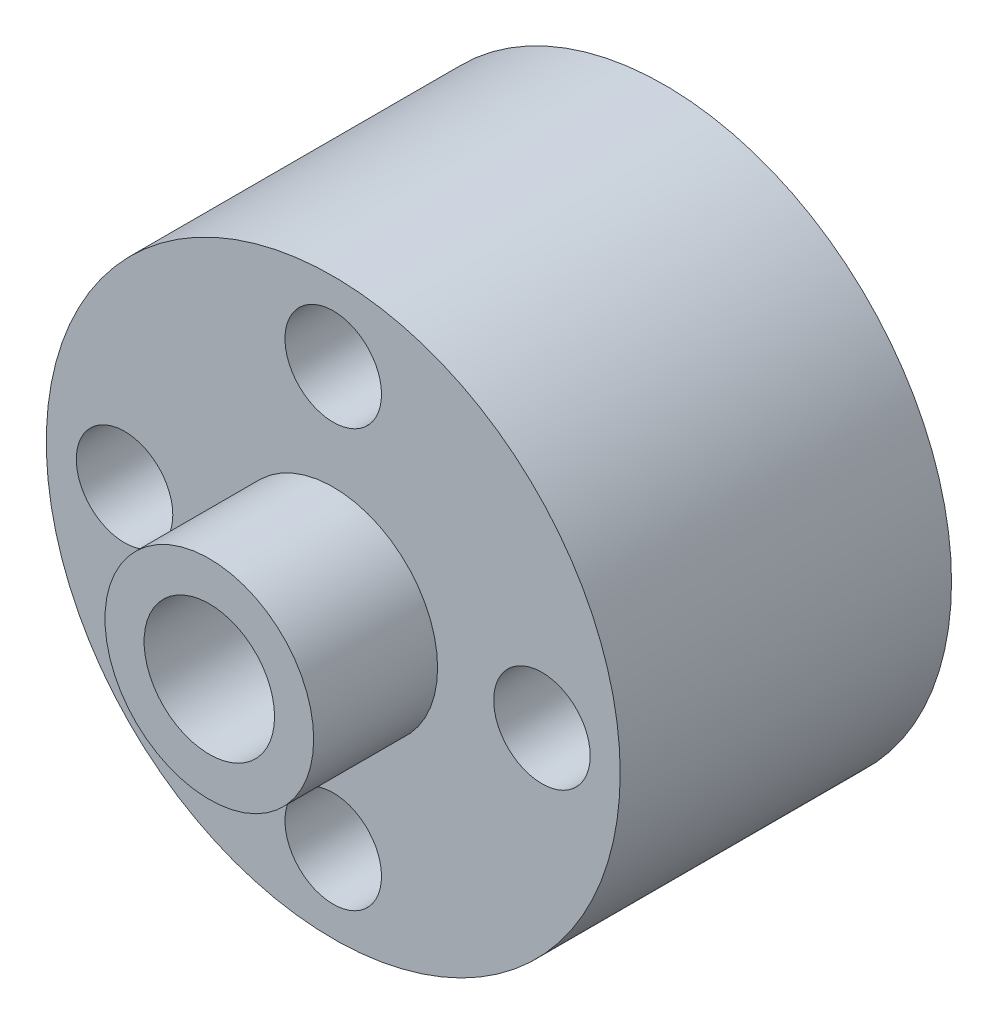
ISO-10303-21;
HEADER;
FILE_DESCRIPTION(('STEP AP214'),'2;1');
FILE_NAME('part.step','',(''),(''),'','','');
FILE_SCHEMA(('AUTOMOTIVE_DESIGN { 1 0 10303 214 1 1 1 1 }'));
ENDSEC;
DATA;
#1=APPLICATION_CONTEXT('core data for automotive mechanical design processes');
#2=APPLICATION_PROTOCOL_DEFINITION('international standard','automotive_design',2000,#1);
#3=PRODUCT_CONTEXT('',#1,'mechanical');
#4=PRODUCT('Part','Part','',(#3));
#5=PRODUCT_RELATED_PRODUCT_CATEGORY('part','',(#4));
#6=PRODUCT_DEFINITION_FORMATION('','',#4);
#7=PRODUCT_DEFINITION_CONTEXT('part definition',#1,'design');
#8=PRODUCT_DEFINITION('design','',#6,#7);
#9=PRODUCT_DEFINITION_SHAPE('','',#8);
#10=(LENGTH_UNIT() NAMED_UNIT(*) SI_UNIT(.MILLI.,.METRE.));
#11=(NAMED_UNIT(*) PLANE_ANGLE_UNIT() SI_UNIT($,.RADIAN.));
#12=(NAMED_UNIT(*) SI_UNIT($,.STERADIAN.) SOLID_ANGLE_UNIT());
#13=UNCERTAINTY_MEASURE_WITH_UNIT(LENGTH_MEASURE(1.E-05),#10,'distance_accuracy_value','');
#14=(GEOMETRIC_REPRESENTATION_CONTEXT(3) GLOBAL_UNCERTAINTY_ASSIGNED_CONTEXT((#13)) GLOBAL_UNIT_ASSIGNED_CONTEXT((#10,
#11,#12)) REPRESENTATION_CONTEXT('',''));
#15=CARTESIAN_POINT('',(0.,0.,0.));
#16=DIRECTION('',(0.,0.,1.));
#17=DIRECTION('',(1.,0.,0.));
#18=AXIS2_PLACEMENT_3D('',#15,#16,#17);
#19=CARTESIAN_POINT('',(0.,0.,6.35));
#20=DIRECTION('',(0.,0.,1.));
#21=DIRECTION('',(1.,0.,0.));
#22=AXIS2_PLACEMENT_3D('',#19,#20,#21);
#23=PLANE('',#22);
#24=CARTESIAN_POINT('',(0.,8.,6.35));
#25=DIRECTION('',(0.,0.,1.));
#26=DIRECTION('',(1.,0.,0.));
#27=AXIS2_PLACEMENT_3D('',#24,#25,#26);
#28=CIRCLE('',#27,1.85);
#29=CARTESIAN_POINT('',(1.85,8.,6.35));
#30=VERTEX_POINT('',#29);
#31=EDGE_CURVE('E70',#30,#30,#28,.T.);
#32=ORIENTED_EDGE('',*,*,#31,.F.);
#33=EDGE_LOOP('',(#32));
#34=FACE_BOUND('',#33,.T.);
#35=CARTESIAN_POINT('',(0.,-8.,6.35));
#36=DIRECTION('',(0.,0.,1.));
#37=DIRECTION('',(1.,0.,0.));
#38=AXIS2_PLACEMENT_3D('',#35,#36,#37);
#39=CIRCLE('',#38,1.85);
#40=CARTESIAN_POINT('',(1.85,-8.,6.35));
#41=VERTEX_POINT('',#40);
#42=EDGE_CURVE('E62',#41,#41,#39,.T.);
#43=ORIENTED_EDGE('',*,*,#42,.F.);
#44=EDGE_LOOP('',(#43));
#45=FACE_BOUND('',#44,.T.);
#46=CARTESIAN_POINT('',(-8.,0.,6.35));
#47=DIRECTION('',(0.,0.,1.));
#48=DIRECTION('',(1.,0.,0.));
#49=AXIS2_PLACEMENT_3D('',#46,#47,#48);
#50=CIRCLE('',#49,1.85);
#51=CARTESIAN_POINT('',(-6.15,0.,6.35));
#52=VERTEX_POINT('',#51);
#53=EDGE_CURVE('E54',#52,#52,#50,.T.);
#54=ORIENTED_EDGE('',*,*,#53,.F.);
#55=EDGE_LOOP('',(#54));
#56=FACE_BOUND('',#55,.T.);
#57=CARTESIAN_POINT('',(8.,0.,6.35));
#58=DIRECTION('',(0.,0.,1.));
#59=DIRECTION('',(1.,0.,0.));
#60=AXIS2_PLACEMENT_3D('',#57,#58,#59);
#61=CIRCLE('',#60,1.85);
#62=CARTESIAN_POINT('',(9.85,0.,6.35));
#63=VERTEX_POINT('',#62);
#64=EDGE_CURVE('E43',#63,#63,#61,.T.);
#65=ORIENTED_EDGE('',*,*,#64,.F.);
#66=EDGE_LOOP('',(#65));
#67=FACE_BOUND('',#66,.T.);
#68=CARTESIAN_POINT('',(0.,0.,6.35));
#69=DIRECTION('',(0.,0.,1.));
#70=DIRECTION('',(1.,0.,0.));
#71=AXIS2_PLACEMENT_3D('',#68,#69,#70);
#72=CIRCLE('',#71,11.);
#73=CARTESIAN_POINT('',(11.,0.,6.35));
#74=VERTEX_POINT('',#73);
#75=EDGE_CURVE('E18',#74,#74,#72,.T.);
#76=ORIENTED_EDGE('',*,*,#75,.T.);
#77=EDGE_LOOP('',(#76));
#78=FACE_BOUND('',#77,.T.);
#79=CARTESIAN_POINT('',(0.,0.,6.35));
#80=DIRECTION('',(0.,0.,1.));
#81=DIRECTION('',(1.,0.,0.));
#82=AXIS2_PLACEMENT_3D('',#79,#80,#81);
#83=CIRCLE('',#82,4.);
#84=CARTESIAN_POINT('',(4.,0.,6.35));
#85=VERTEX_POINT('',#84);
#86=EDGE_CURVE('E31',#85,#85,#83,.T.);
#87=ORIENTED_EDGE('',*,*,#86,.F.);
#88=EDGE_LOOP('',(#87));
#89=FACE_BOUND('',#88,.T.);
#90=ADVANCED_FACE('F14',(#34,#45,#56,#67,#78,#89),#23,.T.);
#91=CARTESIAN_POINT('',(0.,0.,-6.35));
#92=DIRECTION('',(0.,0.,1.));
#93=DIRECTION('',(1.,0.,0.));
#94=AXIS2_PLACEMENT_3D('',#91,#92,#93);
#95=CYLINDRICAL_SURFACE('',#94,11.);
#96=CARTESIAN_POINT('',(0.,0.,-6.35));
#97=DIRECTION('',(0.,0.,1.));
#98=DIRECTION('',(1.,0.,0.));
#99=AXIS2_PLACEMENT_3D('',#96,#97,#98);
#100=CIRCLE('',#99,11.);
#101=CARTESIAN_POINT('',(11.,0.,-6.35));
#102=VERTEX_POINT('',#101);
#103=EDGE_CURVE('E9',#102,#102,#100,.T.);
#104=ORIENTED_EDGE('',*,*,#103,.T.);
#105=EDGE_LOOP('',(#104));
#106=FACE_BOUND('',#105,.T.);
#107=ORIENTED_EDGE('',*,*,#75,.F.);
#108=EDGE_LOOP('',(#107));
#109=FACE_BOUND('',#108,.T.);
#110=ADVANCED_FACE('F16',(#106,#109),#95,.T.);
#111=CARTESIAN_POINT('',(0.,0.,-6.35));
#112=DIRECTION('',(0.,0.,1.));
#113=DIRECTION('',(1.,0.,0.));
#114=AXIS2_PLACEMENT_3D('',#111,#112,#113);
#115=PLANE('',#114);
#116=CARTESIAN_POINT('',(0.,8.,-6.35));
#117=DIRECTION('',(0.,0.,1.));
#118=DIRECTION('',(1.,0.,0.));
#119=AXIS2_PLACEMENT_3D('',#116,#117,#118);
#120=CIRCLE('',#119,1.85);
#121=CARTESIAN_POINT('',(1.85,8.,-6.35));
#122=VERTEX_POINT('',#121);
#123=EDGE_CURVE('E74',#122,#122,#120,.T.);
#124=ORIENTED_EDGE('',*,*,#123,.T.);
#125=EDGE_LOOP('',(#124));
#126=FACE_BOUND('',#125,.T.);
#127=CARTESIAN_POINT('',(0.,-8.,-6.35));
#128=DIRECTION('',(0.,0.,1.));
#129=DIRECTION('',(1.,0.,0.));
#130=AXIS2_PLACEMENT_3D('',#127,#128,#129);
#131=CIRCLE('',#130,1.85);
#132=CARTESIAN_POINT('',(1.85,-8.,-6.35));
#133=VERTEX_POINT('',#132);
#134=EDGE_CURVE('E66',#133,#133,#131,.T.);
#135=ORIENTED_EDGE('',*,*,#134,.T.);
#136=EDGE_LOOP('',(#135));
#137=FACE_BOUND('',#136,.T.);
#138=CARTESIAN_POINT('',(-8.,0.,-6.35));
#139=DIRECTION('',(0.,0.,1.));
#140=DIRECTION('',(1.,0.,0.));
#141=AXIS2_PLACEMENT_3D('',#138,#139,#140);
#142=CIRCLE('',#141,1.85);
#143=CARTESIAN_POINT('',(-6.15,0.,-6.35));
#144=VERTEX_POINT('',#143);
#145=EDGE_CURVE('E58',#144,#144,#142,.T.);
#146=ORIENTED_EDGE('',*,*,#145,.T.);
#147=EDGE_LOOP('',(#146));
#148=FACE_BOUND('',#147,.T.);
#149=CARTESIAN_POINT('',(8.,0.,-6.35));
#150=DIRECTION('',(0.,0.,1.));
#151=DIRECTION('',(1.,0.,0.));
#152=AXIS2_PLACEMENT_3D('',#149,#150,#151);
#153=CIRCLE('',#152,1.85);
#154=CARTESIAN_POINT('',(9.85,0.,-6.35));
#155=VERTEX_POINT('',#154);
#156=EDGE_CURVE('E50',#155,#155,#153,.T.);
#157=ORIENTED_EDGE('',*,*,#156,.T.);
#158=EDGE_LOOP('',(#157));
#159=FACE_BOUND('',#158,.T.);
#160=CARTESIAN_POINT('',(0.,0.,-6.35));
#161=DIRECTION('',(0.,0.,1.));
#162=DIRECTION('',(1.,0.,0.));
#163=AXIS2_PLACEMENT_3D('',#160,#161,#162);
#164=CIRCLE('',#163,4.);
#165=CARTESIAN_POINT('',(4.,0.,-6.35));
#166=VERTEX_POINT('',#165);
#167=EDGE_CURVE('E39',#166,#166,#164,.T.);
#168=ORIENTED_EDGE('',*,*,#167,.T.);
#169=EDGE_LOOP('',(#168));
#170=FACE_BOUND('',#169,.T.);
#171=ORIENTED_EDGE('',*,*,#103,.F.);
#172=EDGE_LOOP('',(#171));
#173=FACE_BOUND('',#172,.T.);
#174=ADVANCED_FACE('F111',(#126,#137,#148,#159,#170,#173),#115,.F.);
#175=CARTESIAN_POINT('',(0.,0.,11.1));
#176=DIRECTION('',(0.,0.,-1.));
#177=DIRECTION('',(-1.,0.,0.));
#178=AXIS2_PLACEMENT_3D('',#175,#176,#177);
#179=CYLINDRICAL_SURFACE('',#178,4.);
#180=CARTESIAN_POINT('',(0.,0.,11.1));
#181=DIRECTION('',(0.,0.,1.));
#182=DIRECTION('',(1.,0.,0.));
#183=AXIS2_PLACEMENT_3D('',#180,#181,#182);
#184=CIRCLE('',#183,4.);
#185=CARTESIAN_POINT('',(4.,0.,11.1));
#186=VERTEX_POINT('',#185);
#187=EDGE_CURVE('E29',#186,#186,#184,.T.);
#188=ORIENTED_EDGE('',*,*,#187,.F.);
#189=EDGE_LOOP('',(#188));
#190=FACE_BOUND('',#189,.T.);
#191=ORIENTED_EDGE('',*,*,#86,.T.);
#192=EDGE_LOOP('',(#191));
#193=FACE_BOUND('',#192,.T.);
#194=ADVANCED_FACE('F105',(#190,#193),#179,.T.);
#195=CARTESIAN_POINT('',(0.,0.,11.1));
#196=DIRECTION('',(0.,0.,1.));
#197=DIRECTION('',(1.,0.,0.));
#198=AXIS2_PLACEMENT_3D('',#195,#196,#197);
#199=PLANE('',#198);
#200=CARTESIAN_POINT('',(0.,0.,11.1));
#201=DIRECTION('',(0.,0.,1.));
#202=DIRECTION('',(1.,0.,0.));
#203=AXIS2_PLACEMENT_3D('',#200,#201,#202);
#204=CIRCLE('',#203,2.5);
#205=CARTESIAN_POINT('',(2.5,0.,11.1));
#206=VERTEX_POINT('',#205);
#207=EDGE_CURVE('E78',#206,#206,#204,.T.);
#208=ORIENTED_EDGE('',*,*,#207,.F.);
#209=EDGE_LOOP('',(#208));
#210=FACE_BOUND('',#209,.T.);
#211=ORIENTED_EDGE('',*,*,#187,.T.);
#212=EDGE_LOOP('',(#211));
#213=FACE_BOUND('',#212,.T.);
#214=ADVANCED_FACE('F101',(#210,#213),#199,.T.);
#215=CARTESIAN_POINT('',(0.,0.,-11.1));
#216=DIRECTION('',(0.,0.,1.));
#217=DIRECTION('',(1.,0.,0.));
#218=AXIS2_PLACEMENT_3D('',#215,#216,#217);
#219=CYLINDRICAL_SURFACE('',#218,4.);
#220=CARTESIAN_POINT('',(0.,0.,-11.1));
#221=DIRECTION('',(0.,0.,1.));
#222=DIRECTION('',(1.,0.,0.));
#223=AXIS2_PLACEMENT_3D('',#220,#221,#222);
#224=CIRCLE('',#223,4.);
#225=CARTESIAN_POINT('',(4.,0.,-11.1));
#226=VERTEX_POINT('',#225);
#227=EDGE_CURVE('E35',#226,#226,#224,.T.);
#228=ORIENTED_EDGE('',*,*,#227,.T.);
#229=EDGE_LOOP('',(#228));
#230=FACE_BOUND('',#229,.T.);
#231=ORIENTED_EDGE('',*,*,#167,.F.);
#232=EDGE_LOOP('',(#231));
#233=FACE_BOUND('',#232,.T.);
#234=ADVANCED_FACE('F104',(#230,#233),#219,.T.);
#235=CARTESIAN_POINT('',(0.,0.,-11.1));
#236=DIRECTION('',(0.,0.,-1.));
#237=DIRECTION('',(1.,0.,0.));
#238=AXIS2_PLACEMENT_3D('',#235,#236,#237);
#239=PLANE('',#238);
#240=CARTESIAN_POINT('',(0.,0.,-11.1));
#241=DIRECTION('',(0.,0.,1.));
#242=DIRECTION('',(1.,0.,0.));
#243=AXIS2_PLACEMENT_3D('',#240,#241,#242);
#244=CIRCLE('',#243,2.5);
#245=CARTESIAN_POINT('',(2.5,0.,-11.1));
#246=VERTEX_POINT('',#245);
#247=EDGE_CURVE('E82',#246,#246,#244,.T.);
#248=ORIENTED_EDGE('',*,*,#247,.T.);
#249=EDGE_LOOP('',(#248));
#250=FACE_BOUND('',#249,.T.);
#251=ORIENTED_EDGE('',*,*,#227,.F.);
#252=EDGE_LOOP('',(#251));
#253=FACE_BOUND('',#252,.T.);
#254=ADVANCED_FACE('F91',(#250,#253),#239,.T.);
#255=CARTESIAN_POINT('',(8.,0.,-6.35));
#256=DIRECTION('',(0.,0.,1.));
#257=DIRECTION('',(1.,0.,0.));
#258=AXIS2_PLACEMENT_3D('',#255,#256,#257);
#259=CYLINDRICAL_SURFACE('',#258,1.85);
#260=ORIENTED_EDGE('',*,*,#156,.F.);
#261=EDGE_LOOP('',(#260));
#262=FACE_BOUND('',#261,.T.);
#263=ORIENTED_EDGE('',*,*,#64,.T.);
#264=EDGE_LOOP('',(#263));
#265=FACE_BOUND('',#264,.T.);
#266=ADVANCED_FACE('F132',(#262,#265),#259,.F.);
#267=CARTESIAN_POINT('',(-8.,0.,-6.35));
#268=DIRECTION('',(0.,0.,1.));
#269=DIRECTION('',(1.,0.,0.));
#270=AXIS2_PLACEMENT_3D('',#267,#268,#269);
#271=CYLINDRICAL_SURFACE('',#270,1.85);
#272=ORIENTED_EDGE('',*,*,#145,.F.);
#273=EDGE_LOOP('',(#272));
#274=FACE_BOUND('',#273,.T.);
#275=ORIENTED_EDGE('',*,*,#53,.T.);
#276=EDGE_LOOP('',(#275));
#277=FACE_BOUND('',#276,.T.);
#278=ADVANCED_FACE('F135',(#274,#277),#271,.F.);
#279=CARTESIAN_POINT('',(0.,-8.,-6.35));
#280=DIRECTION('',(0.,0.,1.));
#281=DIRECTION('',(1.,0.,0.));
#282=AXIS2_PLACEMENT_3D('',#279,#280,#281);
#283=CYLINDRICAL_SURFACE('',#282,1.85);
#284=ORIENTED_EDGE('',*,*,#134,.F.);
#285=EDGE_LOOP('',(#284));
#286=FACE_BOUND('',#285,.T.);
#287=ORIENTED_EDGE('',*,*,#42,.T.);
#288=EDGE_LOOP('',(#287));
#289=FACE_BOUND('',#288,.T.);
#290=ADVANCED_FACE('F139',(#286,#289),#283,.F.);
#291=CARTESIAN_POINT('',(0.,8.,-6.35));
#292=DIRECTION('',(0.,0.,1.));
#293=DIRECTION('',(1.,0.,0.));
#294=AXIS2_PLACEMENT_3D('',#291,#292,#293);
#295=CYLINDRICAL_SURFACE('',#294,1.85);
#296=ORIENTED_EDGE('',*,*,#123,.F.);
#297=EDGE_LOOP('',(#296));
#298=FACE_BOUND('',#297,.T.);
#299=ORIENTED_EDGE('',*,*,#31,.T.);
#300=EDGE_LOOP('',(#299));
#301=FACE_BOUND('',#300,.T.);
#302=ADVANCED_FACE('F97',(#298,#301),#295,.F.);
#303=CARTESIAN_POINT('',(0.,0.,-11.1));
#304=DIRECTION('',(0.,0.,1.));
#305=DIRECTION('',(1.,0.,0.));
#306=AXIS2_PLACEMENT_3D('',#303,#304,#305);
#307=CYLINDRICAL_SURFACE('',#306,2.5);
#308=ORIENTED_EDGE('',*,*,#247,.F.);
#309=EDGE_LOOP('',(#308));
#310=FACE_BOUND('',#309,.T.);
#311=ORIENTED_EDGE('',*,*,#207,.T.);
#312=EDGE_LOOP('',(#311));
#313=FACE_BOUND('',#312,.T.);
#314=ADVANCED_FACE('F94',(#310,#313),#307,.F.);
#315=CLOSED_SHELL('',(#90,#110,#174,#194,#214,#234,#254,#266,#278,#290,#302,#314));
#316=MANIFOLD_SOLID_BREP('B1',#315);
#317=ADVANCED_BREP_SHAPE_REPRESENTATION('',(#18,#316),#14);
#318=SHAPE_DEFINITION_REPRESENTATION(#9,#317);
ENDSEC;
END-ISO-10303-21;
